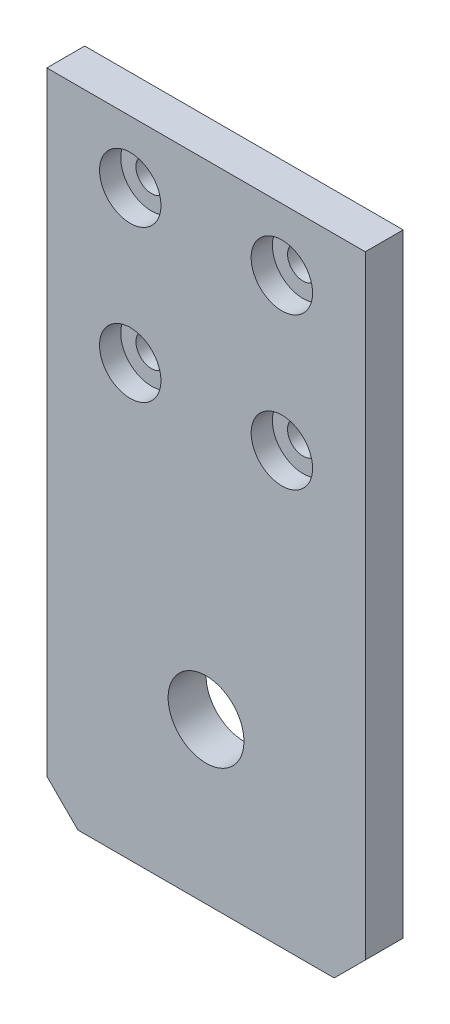
ISO-10303-21;
HEADER;
FILE_DESCRIPTION(('STEP AP214'),'2;1');
FILE_NAME('part.step','',(''),(''),'','','');
FILE_SCHEMA(('AUTOMOTIVE_DESIGN { 1 0 10303 214 1 1 1 1 }'));
ENDSEC;
DATA;
#1=APPLICATION_CONTEXT('core data for automotive mechanical design processes');
#2=APPLICATION_PROTOCOL_DEFINITION('international standard','automotive_design',2000,#1);
#3=PRODUCT_CONTEXT('',#1,'mechanical');
#4=PRODUCT('Part','Part','',(#3));
#5=PRODUCT_RELATED_PRODUCT_CATEGORY('part','',(#4));
#6=PRODUCT_DEFINITION_FORMATION('','',#4);
#7=PRODUCT_DEFINITION_CONTEXT('part definition',#1,'design');
#8=PRODUCT_DEFINITION('design','',#6,#7);
#9=PRODUCT_DEFINITION_SHAPE('','',#8);
#10=(LENGTH_UNIT() NAMED_UNIT(*) SI_UNIT(.MILLI.,.METRE.));
#11=(NAMED_UNIT(*) PLANE_ANGLE_UNIT() SI_UNIT($,.RADIAN.));
#12=(NAMED_UNIT(*) SI_UNIT($,.STERADIAN.) SOLID_ANGLE_UNIT());
#13=UNCERTAINTY_MEASURE_WITH_UNIT(LENGTH_MEASURE(1.E-05),#10,'distance_accuracy_value','');
#14=(GEOMETRIC_REPRESENTATION_CONTEXT(3) GLOBAL_UNCERTAINTY_ASSIGNED_CONTEXT((#13)) GLOBAL_UNIT_ASSIGNED_CONTEXT((#10,
#11,#12)) REPRESENTATION_CONTEXT('',''));
#15=CARTESIAN_POINT('',(0.,0.,0.));
#16=DIRECTION('',(0.,0.,1.));
#17=DIRECTION('',(1.,0.,0.));
#18=AXIS2_PLACEMENT_3D('',#15,#16,#17);
#19=CARTESIAN_POINT('',(31.,76.8,5.));
#20=DIRECTION('',(0.,0.,-1.));
#21=DIRECTION('',(-1.,0.,0.));
#22=AXIS2_PLACEMENT_3D('',#19,#20,#21);
#23=CYLINDRICAL_SURFACE('',#22,2.04999999999999);
#24=CARTESIAN_POINT('',(31.,76.8,0.));
#25=DIRECTION('',(0.,0.,1.));
#26=DIRECTION('',(1.,0.,0.));
#27=AXIS2_PLACEMENT_3D('',#24,#25,#26);
#28=CIRCLE('',#27,2.04999999999999);
#29=CARTESIAN_POINT('',(33.05,76.8,0.));
#30=VERTEX_POINT('',#29);
#31=EDGE_CURVE('E169',#30,#30,#28,.T.);
#32=ORIENTED_EDGE('',*,*,#31,.F.);
#33=EDGE_LOOP('',(#32));
#34=FACE_BOUND('',#33,.T.);
#35=CARTESIAN_POINT('',(31.,76.8,2.2));
#36=DIRECTION('',(0.,0.,1.));
#37=DIRECTION('',(1.,0.,0.));
#38=AXIS2_PLACEMENT_3D('',#35,#36,#37);
#39=CIRCLE('',#38,2.04999999999999);
#40=CARTESIAN_POINT('',(33.05,76.8,2.2));
#41=VERTEX_POINT('',#40);
#42=EDGE_CURVE('E140',#41,#41,#39,.T.);
#43=ORIENTED_EDGE('',*,*,#42,.T.);
#44=EDGE_LOOP('',(#43));
#45=FACE_BOUND('',#44,.T.);
#46=ADVANCED_FACE('F34',(#34,#45),#23,.F.);
#47=CARTESIAN_POINT('',(31.,56.8,5.));
#48=DIRECTION('',(0.,0.,-1.));
#49=DIRECTION('',(-1.,0.,0.));
#50=AXIS2_PLACEMENT_3D('',#47,#48,#49);
#51=CYLINDRICAL_SURFACE('',#50,2.04999999999999);
#52=CARTESIAN_POINT('',(31.,56.8,0.));
#53=DIRECTION('',(0.,0.,1.));
#54=DIRECTION('',(1.,0.,0.));
#55=AXIS2_PLACEMENT_3D('',#52,#53,#54);
#56=CIRCLE('',#55,2.04999999999999);
#57=CARTESIAN_POINT('',(33.05,56.8,0.));
#58=VERTEX_POINT('',#57);
#59=EDGE_CURVE('E172',#58,#58,#56,.T.);
#60=ORIENTED_EDGE('',*,*,#59,.F.);
#61=EDGE_LOOP('',(#60));
#62=FACE_BOUND('',#61,.T.);
#63=CARTESIAN_POINT('',(31.,56.8,2.2));
#64=DIRECTION('',(0.,0.,1.));
#65=DIRECTION('',(1.,0.,0.));
#66=AXIS2_PLACEMENT_3D('',#63,#64,#65);
#67=CIRCLE('',#66,2.04999999999999);
#68=CARTESIAN_POINT('',(33.05,56.8,2.2));
#69=VERTEX_POINT('',#68);
#70=EDGE_CURVE('E135',#69,#69,#67,.T.);
#71=ORIENTED_EDGE('',*,*,#70,.T.);
#72=EDGE_LOOP('',(#71));
#73=FACE_BOUND('',#72,.T.);
#74=ADVANCED_FACE('F236',(#62,#73),#51,.F.);
#75=CARTESIAN_POINT('',(11.,56.8,5.));
#76=DIRECTION('',(0.,0.,-1.));
#77=DIRECTION('',(-1.,0.,0.));
#78=AXIS2_PLACEMENT_3D('',#75,#76,#77);
#79=CYLINDRICAL_SURFACE('',#78,2.05000000000001);
#80=CARTESIAN_POINT('',(11.,56.8,0.));
#81=DIRECTION('',(0.,0.,1.));
#82=DIRECTION('',(1.,0.,0.));
#83=AXIS2_PLACEMENT_3D('',#80,#81,#82);
#84=CIRCLE('',#83,2.05000000000001);
#85=CARTESIAN_POINT('',(13.05,56.8,0.));
#86=VERTEX_POINT('',#85);
#87=EDGE_CURVE('E128',#86,#86,#84,.T.);
#88=ORIENTED_EDGE('',*,*,#87,.F.);
#89=EDGE_LOOP('',(#88));
#90=FACE_BOUND('',#89,.T.);
#91=CARTESIAN_POINT('',(11.,56.8,2.2));
#92=DIRECTION('',(0.,0.,1.));
#93=DIRECTION('',(1.,0.,0.));
#94=AXIS2_PLACEMENT_3D('',#91,#92,#93);
#95=CIRCLE('',#94,2.05000000000001);
#96=CARTESIAN_POINT('',(13.05,56.8,2.2));
#97=VERTEX_POINT('',#96);
#98=EDGE_CURVE('E130',#97,#97,#95,.T.);
#99=ORIENTED_EDGE('',*,*,#98,.T.);
#100=EDGE_LOOP('',(#99));
#101=FACE_BOUND('',#100,.T.);
#102=ADVANCED_FACE('F242',(#90,#101),#79,.F.);
#103=CARTESIAN_POINT('',(11.,76.8,5.));
#104=DIRECTION('',(0.,0.,-1.));
#105=DIRECTION('',(-1.,0.,0.));
#106=AXIS2_PLACEMENT_3D('',#103,#104,#105);
#107=CYLINDRICAL_SURFACE('',#106,2.04999999999999);
#108=CARTESIAN_POINT('',(11.,76.8,0.));
#109=DIRECTION('',(0.,0.,1.));
#110=DIRECTION('',(1.,0.,0.));
#111=AXIS2_PLACEMENT_3D('',#108,#109,#110);
#112=CIRCLE('',#111,2.04999999999999);
#113=CARTESIAN_POINT('',(13.05,76.8,0.));
#114=VERTEX_POINT('',#113);
#115=EDGE_CURVE('E119',#114,#114,#112,.T.);
#116=ORIENTED_EDGE('',*,*,#115,.F.);
#117=EDGE_LOOP('',(#116));
#118=FACE_BOUND('',#117,.T.);
#119=CARTESIAN_POINT('',(11.,76.8,2.2));
#120=DIRECTION('',(0.,0.,1.));
#121=DIRECTION('',(1.,0.,0.));
#122=AXIS2_PLACEMENT_3D('',#119,#120,#121);
#123=CIRCLE('',#122,2.04999999999999);
#124=CARTESIAN_POINT('',(13.05,76.8,2.2));
#125=VERTEX_POINT('',#124);
#126=EDGE_CURVE('E125',#125,#125,#123,.T.);
#127=ORIENTED_EDGE('',*,*,#126,.T.);
#128=EDGE_LOOP('',(#127));
#129=FACE_BOUND('',#128,.T.);
#130=ADVANCED_FACE('F210',(#118,#129),#107,.F.);
#131=CARTESIAN_POINT('',(0.,0.,5.));
#132=DIRECTION('',(0.,0.,1.));
#133=DIRECTION('',(1.,0.,0.));
#134=AXIS2_PLACEMENT_3D('',#131,#132,#133);
#135=PLANE('',#134);
#136=CARTESIAN_POINT('',(21.,21.08,5.));
#137=DIRECTION('',(0.,0.,1.));
#138=DIRECTION('',(1.,0.,0.));
#139=AXIS2_PLACEMENT_3D('',#136,#137,#138);
#140=CIRCLE('',#139,5.);
#141=CARTESIAN_POINT('',(26.,21.08,5.));
#142=VERTEX_POINT('',#141);
#143=EDGE_CURVE('E195',#142,#142,#140,.T.);
#144=ORIENTED_EDGE('',*,*,#143,.F.);
#145=EDGE_LOOP('',(#144));
#146=FACE_BOUND('',#145,.T.);
#147=CARTESIAN_POINT('',(31.,76.8,5.));
#148=DIRECTION('',(0.,0.,1.));
#149=DIRECTION('',(1.,0.,0.));
#150=AXIS2_PLACEMENT_3D('',#147,#148,#149);
#151=CIRCLE('',#150,4.04999999999999);
#152=CARTESIAN_POINT('',(35.05,76.8,5.));
#153=VERTEX_POINT('',#152);
#154=EDGE_CURVE('E189',#153,#153,#151,.T.);
#155=ORIENTED_EDGE('',*,*,#154,.F.);
#156=EDGE_LOOP('',(#155));
#157=FACE_BOUND('',#156,.T.);
#158=CARTESIAN_POINT('',(31.,56.8,5.));
#159=DIRECTION('',(0.,0.,1.));
#160=DIRECTION('',(1.,0.,0.));
#161=AXIS2_PLACEMENT_3D('',#158,#159,#160);
#162=CIRCLE('',#161,4.04999999999999);
#163=CARTESIAN_POINT('',(35.05,56.8,5.));
#164=VERTEX_POINT('',#163);
#165=EDGE_CURVE('E143',#164,#164,#162,.T.);
#166=ORIENTED_EDGE('',*,*,#165,.F.);
#167=EDGE_LOOP('',(#166));
#168=FACE_BOUND('',#167,.T.);
#169=CARTESIAN_POINT('',(11.,56.8,5.));
#170=DIRECTION('',(0.,0.,1.));
#171=DIRECTION('',(1.,0.,0.));
#172=AXIS2_PLACEMENT_3D('',#169,#170,#171);
#173=CIRCLE('',#172,4.05);
#174=CARTESIAN_POINT('',(15.05,56.8,5.));
#175=VERTEX_POINT('',#174);
#176=EDGE_CURVE('E138',#175,#175,#173,.T.);
#177=ORIENTED_EDGE('',*,*,#176,.F.);
#178=EDGE_LOOP('',(#177));
#179=FACE_BOUND('',#178,.T.);
#180=CARTESIAN_POINT('',(11.,76.8,5.));
#181=DIRECTION('',(0.,0.,1.));
#182=DIRECTION('',(1.,0.,0.));
#183=AXIS2_PLACEMENT_3D('',#180,#181,#182);
#184=CIRCLE('',#183,4.05);
#185=CARTESIAN_POINT('',(15.05,76.8,5.));
#186=VERTEX_POINT('',#185);
#187=EDGE_CURVE('E133',#186,#186,#184,.T.);
#188=ORIENTED_EDGE('',*,*,#187,.F.);
#189=EDGE_LOOP('',(#188));
#190=FACE_BOUND('',#189,.T.);
#191=DIRECTION('',(1.,0.,0.));
#192=VECTOR('',#191,1.);
#193=CARTESIAN_POINT('',(0.,0.,5.));
#194=LINE('',#193,#192);
#195=CARTESIAN_POINT('',(4.10000000000001,0.,5.));
#196=VERTEX_POINT('',#195);
#197=CARTESIAN_POINT('',(37.9,0.,5.));
#198=VERTEX_POINT('',#197);
#199=EDGE_CURVE('E98',#196,#198,#194,.T.);
#200=ORIENTED_EDGE('',*,*,#199,.T.);
#201=DIRECTION('',(-0.707106781186549,-0.707106781186546,0.));
#202=VECTOR('',#201,1.);
#203=CARTESIAN_POINT('',(18.9499999999999,-18.95,5.));
#204=LINE('',#203,#202);
#205=CARTESIAN_POINT('',(42.,4.1,5.));
#206=VERTEX_POINT('',#205);
#207=EDGE_CURVE('E42',#198,#206,#204,.F.);
#208=ORIENTED_EDGE('',*,*,#207,.T.);
#209=DIRECTION('',(0.,1.,0.));
#210=VECTOR('',#209,1.);
#211=CARTESIAN_POINT('',(42.,85.,5.));
#212=LINE('',#211,#210);
#213=CARTESIAN_POINT('',(42.,85.,5.));
#214=VERTEX_POINT('',#213);
#215=EDGE_CURVE('E88',#206,#214,#212,.T.);
#216=ORIENTED_EDGE('',*,*,#215,.T.);
#217=DIRECTION('',(-1.,0.,0.));
#218=VECTOR('',#217,1.);
#219=CARTESIAN_POINT('',(0.,85.,5.));
#220=LINE('',#219,#218);
#221=CARTESIAN_POINT('',(0.,85.,5.));
#222=VERTEX_POINT('',#221);
#223=EDGE_CURVE('E92',#214,#222,#220,.T.);
#224=ORIENTED_EDGE('',*,*,#223,.T.);
#225=DIRECTION('',(0.,-1.,0.));
#226=VECTOR('',#225,1.);
#227=CARTESIAN_POINT('',(0.,85.,5.));
#228=LINE('',#227,#226);
#229=CARTESIAN_POINT('',(0.,4.10000000000003,5.));
#230=VERTEX_POINT('',#229);
#231=EDGE_CURVE('E123',#222,#230,#228,.T.);
#232=ORIENTED_EDGE('',*,*,#231,.T.);
#233=DIRECTION('',(-0.707106781186546,0.707106781186549,0.));
#234=VECTOR('',#233,1.);
#235=CARTESIAN_POINT('',(2.05000000000001,2.05,5.));
#236=LINE('',#235,#234);
#237=EDGE_CURVE('E154',#230,#196,#236,.F.);
#238=ORIENTED_EDGE('',*,*,#237,.T.);
#239=EDGE_LOOP('',(#200,#208,#216,#224,#232,#238));
#240=FACE_BOUND('',#239,.T.);
#241=ADVANCED_FACE('F90',(#146,#157,#168,#179,#190,#240),#135,.T.);
#242=CARTESIAN_POINT('',(0.,0.,0.));
#243=DIRECTION('',(0.,0.,1.));
#244=DIRECTION('',(1.,0.,0.));
#245=AXIS2_PLACEMENT_3D('',#242,#243,#244);
#246=PLANE('',#245);
#247=CARTESIAN_POINT('',(21.,21.08,0.));
#248=DIRECTION('',(0.,0.,1.));
#249=DIRECTION('',(1.,0.,0.));
#250=AXIS2_PLACEMENT_3D('',#247,#248,#249);
#251=CIRCLE('',#250,5.);
#252=CARTESIAN_POINT('',(26.,21.08,0.));
#253=VERTEX_POINT('',#252);
#254=EDGE_CURVE('E192',#253,#253,#251,.T.);
#255=ORIENTED_EDGE('',*,*,#254,.T.);
#256=EDGE_LOOP('',(#255));
#257=FACE_BOUND('',#256,.T.);
#258=DIRECTION('',(0.,1.,0.));
#259=VECTOR('',#258,1.);
#260=CARTESIAN_POINT('',(42.,85.,0.));
#261=LINE('',#260,#259);
#262=CARTESIAN_POINT('',(42.,4.1,0.));
#263=VERTEX_POINT('',#262);
#264=CARTESIAN_POINT('',(42.,85.,0.));
#265=VERTEX_POINT('',#264);
#266=EDGE_CURVE('E104',#263,#265,#261,.T.);
#267=ORIENTED_EDGE('',*,*,#266,.F.);
#268=DIRECTION('',(0.707106781186549,0.707106781186546,0.));
#269=VECTOR('',#268,1.);
#270=CARTESIAN_POINT('',(42.,4.10000000000001,0.));
#271=LINE('',#270,#269);
#272=CARTESIAN_POINT('',(37.9,0.,0.));
#273=VERTEX_POINT('',#272);
#274=EDGE_CURVE('E148',#263,#273,#271,.F.);
#275=ORIENTED_EDGE('',*,*,#274,.T.);
#276=DIRECTION('',(1.,0.,0.));
#277=VECTOR('',#276,1.);
#278=CARTESIAN_POINT('',(0.,0.,0.));
#279=LINE('',#278,#277);
#280=CARTESIAN_POINT('',(4.10000000000001,0.,0.));
#281=VERTEX_POINT('',#280);
#282=EDGE_CURVE('E118',#281,#273,#279,.T.);
#283=ORIENTED_EDGE('',*,*,#282,.F.);
#284=DIRECTION('',(0.707106781186546,-0.707106781186549,0.));
#285=VECTOR('',#284,1.);
#286=CARTESIAN_POINT('',(4.10000000000001,0.,0.));
#287=LINE('',#286,#285);
#288=CARTESIAN_POINT('',(0.,4.10000000000002,0.));
#289=VERTEX_POINT('',#288);
#290=EDGE_CURVE('E146',#281,#289,#287,.F.);
#291=ORIENTED_EDGE('',*,*,#290,.T.);
#292=DIRECTION('',(0.,-1.,0.));
#293=VECTOR('',#292,1.);
#294=CARTESIAN_POINT('',(0.,85.,0.));
#295=LINE('',#294,#293);
#296=CARTESIAN_POINT('',(0.,85.,0.));
#297=VERTEX_POINT('',#296);
#298=EDGE_CURVE('E116',#297,#289,#295,.T.);
#299=ORIENTED_EDGE('',*,*,#298,.F.);
#300=DIRECTION('',(-1.,0.,0.));
#301=VECTOR('',#300,1.);
#302=CARTESIAN_POINT('',(0.,85.,0.));
#303=LINE('',#302,#301);
#304=EDGE_CURVE('E122',#265,#297,#303,.T.);
#305=ORIENTED_EDGE('',*,*,#304,.F.);
#306=EDGE_LOOP('',(#267,#275,#283,#291,#299,#305));
#307=FACE_BOUND('',#306,.T.);
#308=ORIENTED_EDGE('',*,*,#115,.T.);
#309=EDGE_LOOP('',(#308));
#310=FACE_BOUND('',#309,.T.);
#311=ORIENTED_EDGE('',*,*,#31,.T.);
#312=EDGE_LOOP('',(#311));
#313=FACE_BOUND('',#312,.T.);
#314=ORIENTED_EDGE('',*,*,#59,.T.);
#315=EDGE_LOOP('',(#314));
#316=FACE_BOUND('',#315,.T.);
#317=ORIENTED_EDGE('',*,*,#87,.T.);
#318=EDGE_LOOP('',(#317));
#319=FACE_BOUND('',#318,.T.);
#320=ADVANCED_FACE('F162',(#257,#307,#310,#313,#316,#319),#246,.F.);
#321=CARTESIAN_POINT('',(0.,85.,5.));
#322=DIRECTION('',(1.,0.,0.));
#323=DIRECTION('',(0.,1.,0.));
#324=AXIS2_PLACEMENT_3D('',#321,#322,#323);
#325=PLANE('',#324);
#326=ORIENTED_EDGE('',*,*,#298,.T.);
#327=DIRECTION('',(0.,0.,1.));
#328=VECTOR('',#327,1.);
#329=CARTESIAN_POINT('',(0.,4.10000000000002,5.));
#330=LINE('',#329,#328);
#331=EDGE_CURVE('E11',#289,#230,#330,.T.);
#332=ORIENTED_EDGE('',*,*,#331,.T.);
#333=ORIENTED_EDGE('',*,*,#231,.F.);
#334=DIRECTION('',(0.,0.,-1.));
#335=VECTOR('',#334,1.);
#336=CARTESIAN_POINT('',(0.,85.,5.));
#337=LINE('',#336,#335);
#338=EDGE_CURVE('E108',#222,#297,#337,.T.);
#339=ORIENTED_EDGE('',*,*,#338,.T.);
#340=EDGE_LOOP('',(#326,#332,#333,#339));
#341=FACE_BOUND('',#340,.T.);
#342=ADVANCED_FACE('F164',(#341),#325,.F.);
#343=CARTESIAN_POINT('',(0.,0.,5.));
#344=DIRECTION('',(0.,1.,0.));
#345=DIRECTION('',(0.,0.,1.));
#346=AXIS2_PLACEMENT_3D('',#343,#344,#345);
#347=PLANE('',#346);
#348=ORIENTED_EDGE('',*,*,#282,.T.);
#349=DIRECTION('',(0.,0.,1.));
#350=VECTOR('',#349,1.);
#351=CARTESIAN_POINT('',(37.9,0.,5.));
#352=LINE('',#351,#350);
#353=EDGE_CURVE('E55',#273,#198,#352,.T.);
#354=ORIENTED_EDGE('',*,*,#353,.T.);
#355=ORIENTED_EDGE('',*,*,#199,.F.);
#356=DIRECTION('',(0.,0.,-1.));
#357=VECTOR('',#356,1.);
#358=CARTESIAN_POINT('',(4.10000000000001,0.,5.));
#359=LINE('',#358,#357);
#360=EDGE_CURVE('E150',#196,#281,#359,.T.);
#361=ORIENTED_EDGE('',*,*,#360,.T.);
#362=EDGE_LOOP('',(#348,#354,#355,#361));
#363=FACE_BOUND('',#362,.T.);
#364=ADVANCED_FACE('F158',(#363),#347,.F.);
#365=CARTESIAN_POINT('',(42.,85.,5.));
#366=DIRECTION('',(-1.,0.,0.));
#367=DIRECTION('',(0.,0.,1.));
#368=AXIS2_PLACEMENT_3D('',#365,#366,#367);
#369=PLANE('',#368);
#370=ORIENTED_EDGE('',*,*,#215,.F.);
#371=DIRECTION('',(0.,0.,-1.));
#372=VECTOR('',#371,1.);
#373=CARTESIAN_POINT('',(42.,4.10000000000001,5.));
#374=LINE('',#373,#372);
#375=EDGE_CURVE('E107',#206,#263,#374,.T.);
#376=ORIENTED_EDGE('',*,*,#375,.T.);
#377=ORIENTED_EDGE('',*,*,#266,.T.);
#378=DIRECTION('',(0.,0.,-1.));
#379=VECTOR('',#378,1.);
#380=CARTESIAN_POINT('',(42.,85.,5.));
#381=LINE('',#380,#379);
#382=EDGE_CURVE('E101',#214,#265,#381,.T.);
#383=ORIENTED_EDGE('',*,*,#382,.F.);
#384=EDGE_LOOP('',(#370,#376,#377,#383));
#385=FACE_BOUND('',#384,.T.);
#386=ADVANCED_FACE('F102',(#385),#369,.F.);
#387=CARTESIAN_POINT('',(0.,85.,5.));
#388=DIRECTION('',(0.,-1.,0.));
#389=DIRECTION('',(0.,0.,-1.));
#390=AXIS2_PLACEMENT_3D('',#387,#388,#389);
#391=PLANE('',#390);
#392=ORIENTED_EDGE('',*,*,#304,.T.);
#393=ORIENTED_EDGE('',*,*,#338,.F.);
#394=ORIENTED_EDGE('',*,*,#223,.F.);
#395=ORIENTED_EDGE('',*,*,#382,.T.);
#396=EDGE_LOOP('',(#392,#393,#394,#395));
#397=FACE_BOUND('',#396,.T.);
#398=ADVANCED_FACE('F110',(#397),#391,.F.);
#399=CARTESIAN_POINT('',(11.,76.8,2.2));
#400=DIRECTION('',(0.,0.,1.));
#401=DIRECTION('',(1.,0.,0.));
#402=AXIS2_PLACEMENT_3D('',#399,#400,#401);
#403=CYLINDRICAL_SURFACE('',#402,4.05);
#404=CARTESIAN_POINT('',(11.,76.8,2.2));
#405=DIRECTION('',(0.,0.,1.));
#406=DIRECTION('',(1.,0.,0.));
#407=AXIS2_PLACEMENT_3D('',#404,#405,#406);
#408=CIRCLE('',#407,4.05);
#409=CARTESIAN_POINT('',(15.05,76.8,2.2));
#410=VERTEX_POINT('',#409);
#411=EDGE_CURVE('E129',#410,#410,#408,.T.);
#412=ORIENTED_EDGE('',*,*,#411,.F.);
#413=EDGE_LOOP('',(#412));
#414=FACE_BOUND('',#413,.T.);
#415=ORIENTED_EDGE('',*,*,#187,.T.);
#416=EDGE_LOOP('',(#415));
#417=FACE_BOUND('',#416,.T.);
#418=ADVANCED_FACE('F220',(#414,#417),#403,.F.);
#419=CARTESIAN_POINT('',(11.,76.8,2.2));
#420=DIRECTION('',(0.,0.,1.));
#421=DIRECTION('',(1.,0.,0.));
#422=AXIS2_PLACEMENT_3D('',#419,#420,#421);
#423=PLANE('',#422);
#424=ORIENTED_EDGE('',*,*,#126,.F.);
#425=EDGE_LOOP('',(#424));
#426=FACE_BOUND('',#425,.T.);
#427=ORIENTED_EDGE('',*,*,#411,.T.);
#428=EDGE_LOOP('',(#427));
#429=FACE_BOUND('',#428,.T.);
#430=ADVANCED_FACE('F222',(#426,#429),#423,.T.);
#431=CARTESIAN_POINT('',(11.,56.8,2.2));
#432=DIRECTION('',(0.,0.,1.));
#433=DIRECTION('',(1.,0.,0.));
#434=AXIS2_PLACEMENT_3D('',#431,#432,#433);
#435=CYLINDRICAL_SURFACE('',#434,4.05);
#436=CARTESIAN_POINT('',(11.,56.8,2.2));
#437=DIRECTION('',(0.,0.,1.));
#438=DIRECTION('',(1.,0.,0.));
#439=AXIS2_PLACEMENT_3D('',#436,#437,#438);
#440=CIRCLE('',#439,4.05);
#441=CARTESIAN_POINT('',(15.05,56.8,2.2));
#442=VERTEX_POINT('',#441);
#443=EDGE_CURVE('E134',#442,#442,#440,.T.);
#444=ORIENTED_EDGE('',*,*,#443,.F.);
#445=EDGE_LOOP('',(#444));
#446=FACE_BOUND('',#445,.T.);
#447=ORIENTED_EDGE('',*,*,#176,.T.);
#448=EDGE_LOOP('',(#447));
#449=FACE_BOUND('',#448,.T.);
#450=ADVANCED_FACE('F229',(#446,#449),#435,.F.);
#451=CARTESIAN_POINT('',(11.,56.8,2.2));
#452=DIRECTION('',(0.,0.,1.));
#453=DIRECTION('',(1.,0.,0.));
#454=AXIS2_PLACEMENT_3D('',#451,#452,#453);
#455=PLANE('',#454);
#456=ORIENTED_EDGE('',*,*,#98,.F.);
#457=EDGE_LOOP('',(#456));
#458=FACE_BOUND('',#457,.T.);
#459=ORIENTED_EDGE('',*,*,#443,.T.);
#460=EDGE_LOOP('',(#459));
#461=FACE_BOUND('',#460,.T.);
#462=ADVANCED_FACE('F284',(#458,#461),#455,.T.);
#463=CARTESIAN_POINT('',(31.,56.8,2.2));
#464=DIRECTION('',(0.,0.,1.));
#465=DIRECTION('',(1.,0.,0.));
#466=AXIS2_PLACEMENT_3D('',#463,#464,#465);
#467=CYLINDRICAL_SURFACE('',#466,4.04999999999999);
#468=CARTESIAN_POINT('',(31.,56.8,2.2));
#469=DIRECTION('',(0.,0.,1.));
#470=DIRECTION('',(1.,0.,0.));
#471=AXIS2_PLACEMENT_3D('',#468,#469,#470);
#472=CIRCLE('',#471,4.04999999999999);
#473=CARTESIAN_POINT('',(35.05,56.8,2.2));
#474=VERTEX_POINT('',#473);
#475=EDGE_CURVE('E139',#474,#474,#472,.T.);
#476=ORIENTED_EDGE('',*,*,#475,.F.);
#477=EDGE_LOOP('',(#476));
#478=FACE_BOUND('',#477,.T.);
#479=ORIENTED_EDGE('',*,*,#165,.T.);
#480=EDGE_LOOP('',(#479));
#481=FACE_BOUND('',#480,.T.);
#482=ADVANCED_FACE('F280',(#478,#481),#467,.F.);
#483=CARTESIAN_POINT('',(31.,56.8,2.2));
#484=DIRECTION('',(0.,0.,1.));
#485=DIRECTION('',(1.,0.,0.));
#486=AXIS2_PLACEMENT_3D('',#483,#484,#485);
#487=PLANE('',#486);
#488=ORIENTED_EDGE('',*,*,#70,.F.);
#489=EDGE_LOOP('',(#488));
#490=FACE_BOUND('',#489,.T.);
#491=ORIENTED_EDGE('',*,*,#475,.T.);
#492=EDGE_LOOP('',(#491));
#493=FACE_BOUND('',#492,.T.);
#494=ADVANCED_FACE('F272',(#490,#493),#487,.T.);
#495=CARTESIAN_POINT('',(31.,76.8,2.2));
#496=DIRECTION('',(0.,0.,1.));
#497=DIRECTION('',(1.,0.,0.));
#498=AXIS2_PLACEMENT_3D('',#495,#496,#497);
#499=CYLINDRICAL_SURFACE('',#498,4.04999999999999);
#500=CARTESIAN_POINT('',(31.,76.8,2.2));
#501=DIRECTION('',(0.,0.,1.));
#502=DIRECTION('',(1.,0.,0.));
#503=AXIS2_PLACEMENT_3D('',#500,#501,#502);
#504=CIRCLE('',#503,4.04999999999999);
#505=CARTESIAN_POINT('',(35.05,76.8,2.2));
#506=VERTEX_POINT('',#505);
#507=EDGE_CURVE('E144',#506,#506,#504,.T.);
#508=ORIENTED_EDGE('',*,*,#507,.F.);
#509=EDGE_LOOP('',(#508));
#510=FACE_BOUND('',#509,.T.);
#511=ORIENTED_EDGE('',*,*,#154,.T.);
#512=EDGE_LOOP('',(#511));
#513=FACE_BOUND('',#512,.T.);
#514=ADVANCED_FACE('F266',(#510,#513),#499,.F.);
#515=CARTESIAN_POINT('',(31.,76.8,2.2));
#516=DIRECTION('',(0.,0.,1.));
#517=DIRECTION('',(1.,0.,0.));
#518=AXIS2_PLACEMENT_3D('',#515,#516,#517);
#519=PLANE('',#518);
#520=ORIENTED_EDGE('',*,*,#42,.F.);
#521=EDGE_LOOP('',(#520));
#522=FACE_BOUND('',#521,.T.);
#523=ORIENTED_EDGE('',*,*,#507,.T.);
#524=EDGE_LOOP('',(#523));
#525=FACE_BOUND('',#524,.T.);
#526=ADVANCED_FACE('F260',(#522,#525),#519,.T.);
#527=CARTESIAN_POINT('',(42.,4.10000000000001,5.));
#528=DIRECTION('',(-0.707106781186546,0.707106781186549,0.));
#529=DIRECTION('',(0.,0.,-1.));
#530=AXIS2_PLACEMENT_3D('',#527,#528,#529);
#531=PLANE('',#530);
#532=ORIENTED_EDGE('',*,*,#207,.F.);
#533=ORIENTED_EDGE('',*,*,#353,.F.);
#534=ORIENTED_EDGE('',*,*,#274,.F.);
#535=ORIENTED_EDGE('',*,*,#375,.F.);
#536=EDGE_LOOP('',(#532,#533,#534,#535));
#537=FACE_BOUND('',#536,.T.);
#538=ADVANCED_FACE('F258',(#537),#531,.F.);
#539=CARTESIAN_POINT('',(4.10000000000001,0.,5.));
#540=DIRECTION('',(0.707106781186549,0.707106781186546,0.));
#541=DIRECTION('',(0.,0.,-1.));
#542=AXIS2_PLACEMENT_3D('',#539,#540,#541);
#543=PLANE('',#542);
#544=ORIENTED_EDGE('',*,*,#237,.F.);
#545=ORIENTED_EDGE('',*,*,#331,.F.);
#546=ORIENTED_EDGE('',*,*,#290,.F.);
#547=ORIENTED_EDGE('',*,*,#360,.F.);
#548=EDGE_LOOP('',(#544,#545,#546,#547));
#549=FACE_BOUND('',#548,.T.);
#550=ADVANCED_FACE('F36',(#549),#543,.F.);
#551=CARTESIAN_POINT('',(21.,21.08,0.));
#552=DIRECTION('',(0.,0.,1.));
#553=DIRECTION('',(1.,0.,0.));
#554=AXIS2_PLACEMENT_3D('',#551,#552,#553);
#555=CYLINDRICAL_SURFACE('',#554,5.);
#556=ORIENTED_EDGE('',*,*,#254,.F.);
#557=EDGE_LOOP('',(#556));
#558=FACE_BOUND('',#557,.T.);
#559=ORIENTED_EDGE('',*,*,#143,.T.);
#560=EDGE_LOOP('',(#559));
#561=FACE_BOUND('',#560,.T.);
#562=ADVANCED_FACE('F202',(#558,#561),#555,.F.);
#563=CLOSED_SHELL('',(#46,#74,#102,#130,#241,#320,#342,#364,#386,#398,#418,#430,#450,#462,#482,
#494,#514,#526,#538,#550,#562));
#564=MANIFOLD_SOLID_BREP('B2',#563);
#565=ADVANCED_BREP_SHAPE_REPRESENTATION('',(#18,#564),#14);
#566=SHAPE_DEFINITION_REPRESENTATION(#9,#565);
ENDSEC;
END-ISO-10303-21;
